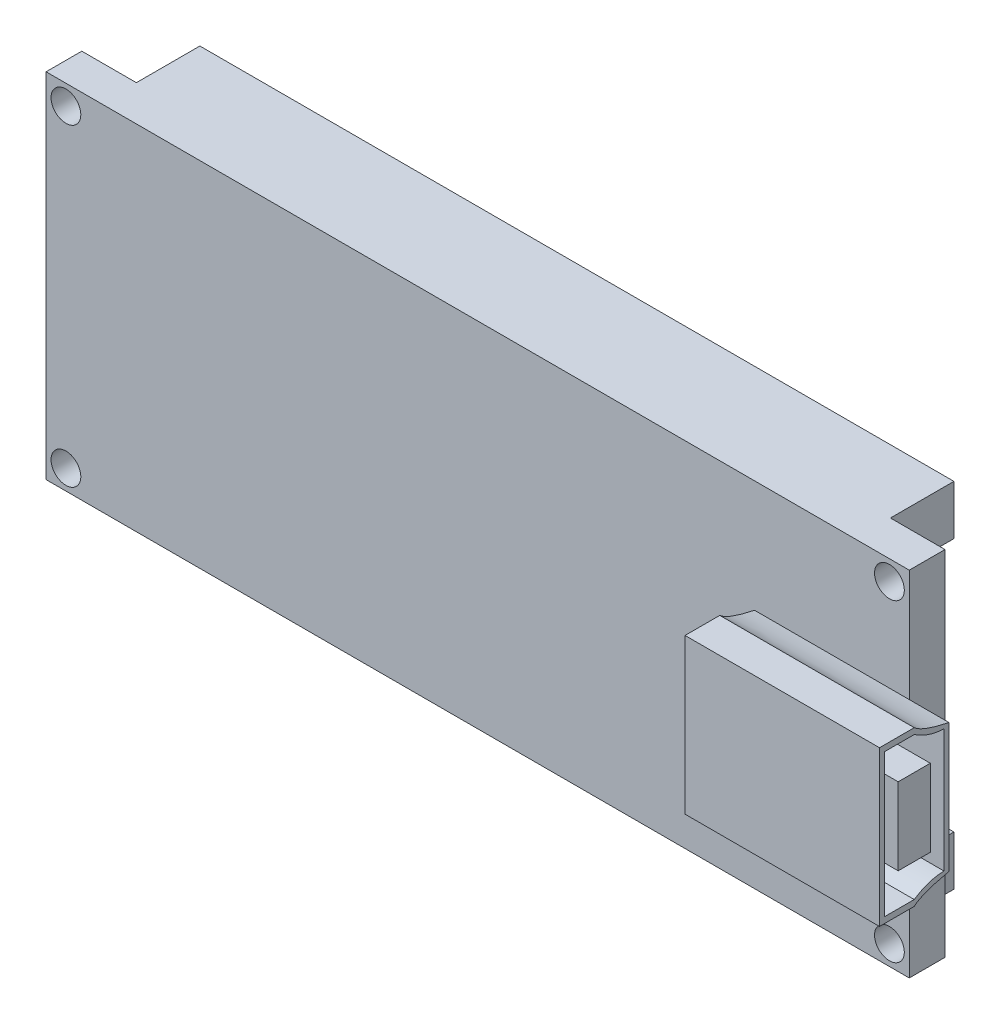
ISO-10303-21;
HEADER;
FILE_DESCRIPTION(('STEP AP214'),'2;1');
FILE_NAME('part.step','',(''),(''),'','','');
FILE_SCHEMA(('AUTOMOTIVE_DESIGN { 1 0 10303 214 1 1 1 1 }'));
ENDSEC;
DATA;
#1=APPLICATION_CONTEXT('core data for automotive mechanical design processes');
#2=APPLICATION_PROTOCOL_DEFINITION('international standard','automotive_design',2000,#1);
#3=PRODUCT_CONTEXT('',#1,'mechanical');
#4=PRODUCT('Part','Part','',(#3));
#5=PRODUCT_RELATED_PRODUCT_CATEGORY('part','',(#4));
#6=PRODUCT_DEFINITION_FORMATION('','',#4);
#7=PRODUCT_DEFINITION_CONTEXT('part definition',#1,'design');
#8=PRODUCT_DEFINITION('design','',#6,#7);
#9=PRODUCT_DEFINITION_SHAPE('','',#8);
#10=(LENGTH_UNIT() NAMED_UNIT(*) SI_UNIT(.MILLI.,.METRE.));
#11=(NAMED_UNIT(*) PLANE_ANGLE_UNIT() SI_UNIT($,.RADIAN.));
#12=(NAMED_UNIT(*) SI_UNIT($,.STERADIAN.) SOLID_ANGLE_UNIT());
#13=UNCERTAINTY_MEASURE_WITH_UNIT(LENGTH_MEASURE(1.E-05),#10,'distance_accuracy_value','');
#14=(GEOMETRIC_REPRESENTATION_CONTEXT(3) GLOBAL_UNCERTAINTY_ASSIGNED_CONTEXT((#13)) GLOBAL_UNIT_ASSIGNED_CONTEXT((#10,
#11,#12)) REPRESENTATION_CONTEXT('',''));
#15=CARTESIAN_POINT('',(0.,0.,0.));
#16=DIRECTION('',(0.,0.,1.));
#17=DIRECTION('',(1.,0.,0.));
#18=AXIS2_PLACEMENT_3D('',#15,#16,#17);
#19=CARTESIAN_POINT('',(0.,0.,0.));
#20=DIRECTION('',(0.,0.,1.));
#21=DIRECTION('',(1.,0.,0.));
#22=AXIS2_PLACEMENT_3D('',#19,#20,#21);
#23=PLANE('',#22);
#24=CARTESIAN_POINT('',(20.75,7.9,0.));
#25=DIRECTION('',(0.,0.,1.));
#26=DIRECTION('',(1.,0.,0.));
#27=AXIS2_PLACEMENT_3D('',#24,#25,#26);
#28=CIRCLE('',#27,0.750000000000002);
#29=CARTESIAN_POINT('',(21.5,7.9,0.));
#30=VERTEX_POINT('',#29);
#31=EDGE_CURVE('E455',#30,#30,#28,.F.);
#32=ORIENTED_EDGE('',*,*,#31,.F.);
#33=EDGE_LOOP('',(#32));
#34=FACE_BOUND('',#33,.T.);
#35=CARTESIAN_POINT('',(-20.75,7.9,0.));
#36=DIRECTION('',(0.,0.,1.));
#37=DIRECTION('',(1.,0.,0.));
#38=AXIS2_PLACEMENT_3D('',#35,#36,#37);
#39=CIRCLE('',#38,0.750000000000002);
#40=CARTESIAN_POINT('',(-20.,7.9,0.));
#41=VERTEX_POINT('',#40);
#42=EDGE_CURVE('E484',#41,#41,#39,.T.);
#43=ORIENTED_EDGE('',*,*,#42,.T.);
#44=EDGE_LOOP('',(#43));
#45=FACE_BOUND('',#44,.T.);
#46=CARTESIAN_POINT('',(20.75,-7.89999999999999,0.));
#47=DIRECTION('',(0.,0.,1.));
#48=DIRECTION('',(1.,0.,0.));
#49=AXIS2_PLACEMENT_3D('',#46,#47,#48);
#50=CIRCLE('',#49,0.750000000000002);
#51=CARTESIAN_POINT('',(21.5,-7.89999999999999,0.));
#52=VERTEX_POINT('',#51);
#53=EDGE_CURVE('E500',#52,#52,#50,.T.);
#54=ORIENTED_EDGE('',*,*,#53,.T.);
#55=EDGE_LOOP('',(#54));
#56=FACE_BOUND('',#55,.T.);
#57=CARTESIAN_POINT('',(-20.75,-7.90000000000001,0.));
#58=DIRECTION('',(0.,0.,1.));
#59=DIRECTION('',(1.,0.,0.));
#60=AXIS2_PLACEMENT_3D('',#57,#58,#59);
#61=CIRCLE('',#60,0.750000000000002);
#62=CARTESIAN_POINT('',(-20.,-7.90000000000001,0.));
#63=VERTEX_POINT('',#62);
#64=EDGE_CURVE('E460',#63,#63,#61,.F.);
#65=ORIENTED_EDGE('',*,*,#64,.F.);
#66=EDGE_LOOP('',(#65));
#67=FACE_BOUND('',#66,.T.);
#68=DIRECTION('',(0.,-1.,0.));
#69=VECTOR('',#68,1.);
#70=CARTESIAN_POINT('',(19.,-6.4,0.));
#71=LINE('',#70,#69);
#72=CARTESIAN_POINT('',(19.,-6.4,0.));
#73=VERTEX_POINT('',#72);
#74=CARTESIAN_POINT('',(19.,-8.9,0.));
#75=VERTEX_POINT('',#74);
#76=EDGE_CURVE('E92',#73,#75,#71,.T.);
#77=ORIENTED_EDGE('',*,*,#76,.F.);
#78=DIRECTION('',(1.,0.,0.));
#79=VECTOR('',#78,1.);
#80=CARTESIAN_POINT('',(-19.,-6.4,0.));
#81=LINE('',#80,#79);
#82=CARTESIAN_POINT('',(-19.,-6.4,0.));
#83=VERTEX_POINT('',#82);
#84=EDGE_CURVE('E97',#83,#73,#81,.T.);
#85=ORIENTED_EDGE('',*,*,#84,.F.);
#86=DIRECTION('',(0.,1.,0.));
#87=VECTOR('',#86,1.);
#88=CARTESIAN_POINT('',(-19.,-6.4,0.));
#89=LINE('',#88,#87);
#90=CARTESIAN_POINT('',(-19.,-8.9,0.));
#91=VERTEX_POINT('',#90);
#92=EDGE_CURVE('E286',#91,#83,#89,.T.);
#93=ORIENTED_EDGE('',*,*,#92,.F.);
#94=DIRECTION('',(-1.,0.,0.));
#95=VECTOR('',#94,1.);
#96=CARTESIAN_POINT('',(0.,-8.9,0.));
#97=LINE('',#96,#95);
#98=CARTESIAN_POINT('',(-21.75,-8.9,0.));
#99=VERTEX_POINT('',#98);
#100=EDGE_CURVE('E490',#91,#99,#97,.T.);
#101=ORIENTED_EDGE('',*,*,#100,.T.);
#102=DIRECTION('',(0.,1.,0.));
#103=VECTOR('',#102,1.);
#104=CARTESIAN_POINT('',(-21.75,0.,0.));
#105=LINE('',#104,#103);
#106=CARTESIAN_POINT('',(-21.75,8.9,0.));
#107=VERTEX_POINT('',#106);
#108=EDGE_CURVE('E487',#99,#107,#105,.T.);
#109=ORIENTED_EDGE('',*,*,#108,.T.);
#110=DIRECTION('',(-1.,0.,0.));
#111=VECTOR('',#110,1.);
#112=CARTESIAN_POINT('',(0.,8.9,0.));
#113=LINE('',#112,#111);
#114=CARTESIAN_POINT('',(-19.,8.9,0.));
#115=VERTEX_POINT('',#114);
#116=EDGE_CURVE('E496',#115,#107,#113,.T.);
#117=ORIENTED_EDGE('',*,*,#116,.F.);
#118=DIRECTION('',(0.,1.,0.));
#119=VECTOR('',#118,1.);
#120=CARTESIAN_POINT('',(-19.,6.4,0.));
#121=LINE('',#120,#119);
#122=CARTESIAN_POINT('',(-19.,6.4,0.));
#123=VERTEX_POINT('',#122);
#124=EDGE_CURVE('E302',#123,#115,#121,.T.);
#125=ORIENTED_EDGE('',*,*,#124,.F.);
#126=DIRECTION('',(-1.,0.,0.));
#127=VECTOR('',#126,1.);
#128=CARTESIAN_POINT('',(-19.,6.4,0.));
#129=LINE('',#128,#127);
#130=CARTESIAN_POINT('',(19.,6.4,0.));
#131=VERTEX_POINT('',#130);
#132=EDGE_CURVE('E292',#131,#123,#129,.T.);
#133=ORIENTED_EDGE('',*,*,#132,.F.);
#134=DIRECTION('',(0.,-1.,0.));
#135=VECTOR('',#134,1.);
#136=CARTESIAN_POINT('',(19.,6.4,0.));
#137=LINE('',#136,#135);
#138=CARTESIAN_POINT('',(19.,8.9,0.));
#139=VERTEX_POINT('',#138);
#140=EDGE_CURVE('E289',#139,#131,#137,.T.);
#141=ORIENTED_EDGE('',*,*,#140,.F.);
#142=CARTESIAN_POINT('',(21.75,8.9,0.));
#143=VERTEX_POINT('',#142);
#144=EDGE_CURVE('E497',#143,#139,#113,.T.);
#145=ORIENTED_EDGE('',*,*,#144,.F.);
#146=DIRECTION('',(0.,1.,0.));
#147=VECTOR('',#146,1.);
#148=CARTESIAN_POINT('',(21.75,0.,0.));
#149=LINE('',#148,#147);
#150=CARTESIAN_POINT('',(21.75,-8.9,0.));
#151=VERTEX_POINT('',#150);
#152=EDGE_CURVE('E493',#151,#143,#149,.T.);
#153=ORIENTED_EDGE('',*,*,#152,.F.);
#154=EDGE_CURVE('E491',#151,#75,#97,.T.);
#155=ORIENTED_EDGE('',*,*,#154,.T.);
#156=EDGE_LOOP('',(#77,#85,#93,#101,#109,#117,#125,#133,#141,#145,#153,#155));
#157=FACE_BOUND('',#156,.T.);
#158=ADVANCED_FACE('F75',(#34,#45,#56,#67,#157),#23,.F.);
#159=CARTESIAN_POINT('',(-21.75,0.,1.8));
#160=DIRECTION('',(-1.,0.,0.));
#161=DIRECTION('',(0.,0.,1.));
#162=AXIS2_PLACEMENT_3D('',#159,#160,#161);
#163=PLANE('',#162);
#164=ORIENTED_EDGE('',*,*,#108,.F.);
#165=DIRECTION('',(0.,0.,-1.));
#166=VECTOR('',#165,1.);
#167=CARTESIAN_POINT('',(-21.75,-8.9,1.8));
#168=LINE('',#167,#166);
#169=CARTESIAN_POINT('',(-21.75,-8.9,1.8));
#170=VERTEX_POINT('',#169);
#171=EDGE_CURVE('E512',#170,#99,#168,.T.);
#172=ORIENTED_EDGE('',*,*,#171,.F.);
#173=DIRECTION('',(0.,1.,0.));
#174=VECTOR('',#173,1.);
#175=CARTESIAN_POINT('',(-21.75,0.,1.8));
#176=LINE('',#175,#174);
#177=CARTESIAN_POINT('',(-21.75,8.9,1.8));
#178=VERTEX_POINT('',#177);
#179=EDGE_CURVE('E463',#170,#178,#176,.T.);
#180=ORIENTED_EDGE('',*,*,#179,.T.);
#181=DIRECTION('',(0.,0.,-1.));
#182=VECTOR('',#181,1.);
#183=CARTESIAN_POINT('',(-21.75,8.9,1.8));
#184=LINE('',#183,#182);
#185=EDGE_CURVE('E481',#178,#107,#184,.T.);
#186=ORIENTED_EDGE('',*,*,#185,.T.);
#187=EDGE_LOOP('',(#164,#172,#180,#186));
#188=FACE_BOUND('',#187,.T.);
#189=ADVANCED_FACE('F563',(#188),#163,.T.);
#190=CARTESIAN_POINT('',(0.,-8.9,1.8));
#191=DIRECTION('',(0.,-1.,0.));
#192=DIRECTION('',(1.,0.,0.));
#193=AXIS2_PLACEMENT_3D('',#190,#191,#192);
#194=PLANE('',#193);
#195=ORIENTED_EDGE('',*,*,#154,.F.);
#196=DIRECTION('',(0.,0.,-1.));
#197=VECTOR('',#196,1.);
#198=CARTESIAN_POINT('',(21.75,-8.9,1.8));
#199=LINE('',#198,#197);
#200=CARTESIAN_POINT('',(21.75,-8.9,1.8));
#201=VERTEX_POINT('',#200);
#202=EDGE_CURVE('E510',#201,#151,#199,.T.);
#203=ORIENTED_EDGE('',*,*,#202,.F.);
#204=DIRECTION('',(-1.,0.,0.));
#205=VECTOR('',#204,1.);
#206=CARTESIAN_POINT('',(0.,-8.9,1.8));
#207=LINE('',#206,#205);
#208=EDGE_CURVE('E465',#201,#170,#207,.T.);
#209=ORIENTED_EDGE('',*,*,#208,.T.);
#210=ORIENTED_EDGE('',*,*,#171,.T.);
#211=ORIENTED_EDGE('',*,*,#100,.F.);
#212=DIRECTION('',(0.,0.,1.));
#213=VECTOR('',#212,1.);
#214=CARTESIAN_POINT('',(-19.,-8.9,-3.2));
#215=LINE('',#214,#213);
#216=CARTESIAN_POINT('',(-19.,-8.9,-3.2));
#217=VERTEX_POINT('',#216);
#218=EDGE_CURVE('E294',#217,#91,#215,.T.);
#219=ORIENTED_EDGE('',*,*,#218,.F.);
#220=DIRECTION('',(-1.,0.,0.));
#221=VECTOR('',#220,1.);
#222=CARTESIAN_POINT('',(-19.,-8.9,-3.2));
#223=LINE('',#222,#221);
#224=CARTESIAN_POINT('',(19.,-8.9,-3.2));
#225=VERTEX_POINT('',#224);
#226=EDGE_CURVE('E276',#225,#217,#223,.T.);
#227=ORIENTED_EDGE('',*,*,#226,.F.);
#228=DIRECTION('',(0.,0.,1.));
#229=VECTOR('',#228,1.);
#230=CARTESIAN_POINT('',(19.,-8.9,-3.2));
#231=LINE('',#230,#229);
#232=EDGE_CURVE('E273',#225,#75,#231,.T.);
#233=ORIENTED_EDGE('',*,*,#232,.T.);
#234=EDGE_LOOP('',(#195,#203,#209,#210,#211,#219,#227,#233));
#235=FACE_BOUND('',#234,.T.);
#236=ADVANCED_FACE('F569',(#235),#194,.T.);
#237=CARTESIAN_POINT('',(21.75,0.,1.8));
#238=DIRECTION('',(-1.,0.,0.));
#239=DIRECTION('',(0.,0.,1.));
#240=AXIS2_PLACEMENT_3D('',#237,#238,#239);
#241=PLANE('',#240);
#242=ORIENTED_EDGE('',*,*,#152,.T.);
#243=DIRECTION('',(0.,0.,-1.));
#244=VECTOR('',#243,1.);
#245=CARTESIAN_POINT('',(21.75,8.9,1.8));
#246=LINE('',#245,#244);
#247=CARTESIAN_POINT('',(21.75,8.9,1.8));
#248=VERTEX_POINT('',#247);
#249=EDGE_CURVE('E507',#248,#143,#246,.T.);
#250=ORIENTED_EDGE('',*,*,#249,.F.);
#251=DIRECTION('',(0.,1.,0.));
#252=VECTOR('',#251,1.);
#253=CARTESIAN_POINT('',(21.75,0.,1.8));
#254=LINE('',#253,#252);
#255=CARTESIAN_POINT('',(21.75,3.25000000000001,1.8));
#256=VERTEX_POINT('',#255);
#257=EDGE_CURVE('E468',#256,#248,#254,.T.);
#258=ORIENTED_EDGE('',*,*,#257,.F.);
#259=CARTESIAN_POINT('',(21.75,-3.24999999999999,1.8));
#260=VERTEX_POINT('',#259);
#261=EDGE_CURVE('E472',#260,#256,#254,.T.);
#262=ORIENTED_EDGE('',*,*,#261,.F.);
#263=EDGE_CURVE('E469',#201,#260,#254,.T.);
#264=ORIENTED_EDGE('',*,*,#263,.F.);
#265=ORIENTED_EDGE('',*,*,#202,.T.);
#266=EDGE_LOOP('',(#242,#250,#258,#262,#264,#265));
#267=FACE_BOUND('',#266,.T.);
#268=ADVANCED_FACE('F585',(#267),#241,.F.);
#269=CARTESIAN_POINT('',(20.75,-7.89999999999999,1.8));
#270=DIRECTION('',(0.,0.,-1.));
#271=DIRECTION('',(-1.,0.,0.));
#272=AXIS2_PLACEMENT_3D('',#269,#270,#271);
#273=CYLINDRICAL_SURFACE('',#272,0.750000000000002);
#274=CARTESIAN_POINT('',(20.75,-7.89999999999999,1.8));
#275=DIRECTION('',(0.,0.,1.));
#276=DIRECTION('',(1.,0.,0.));
#277=AXIS2_PLACEMENT_3D('',#274,#275,#276);
#278=CIRCLE('',#277,0.750000000000002);
#279=CARTESIAN_POINT('',(21.5,-7.89999999999999,1.8));
#280=VERTEX_POINT('',#279);
#281=EDGE_CURVE('E475',#280,#280,#278,.T.);
#282=ORIENTED_EDGE('',*,*,#281,.T.);
#283=EDGE_LOOP('',(#282));
#284=FACE_BOUND('',#283,.T.);
#285=ORIENTED_EDGE('',*,*,#53,.F.);
#286=EDGE_LOOP('',(#285));
#287=FACE_BOUND('',#286,.T.);
#288=ADVANCED_FACE('F581',(#284,#287),#273,.F.);
#289=CARTESIAN_POINT('',(0.,8.9,1.8));
#290=DIRECTION('',(0.,-1.,0.));
#291=DIRECTION('',(1.,0.,0.));
#292=AXIS2_PLACEMENT_3D('',#289,#290,#291);
#293=PLANE('',#292);
#294=ORIENTED_EDGE('',*,*,#144,.T.);
#295=DIRECTION('',(0.,0.,1.));
#296=VECTOR('',#295,1.);
#297=CARTESIAN_POINT('',(19.,8.9,-3.2));
#298=LINE('',#297,#296);
#299=CARTESIAN_POINT('',(19.,8.9,-3.2));
#300=VERTEX_POINT('',#299);
#301=EDGE_CURVE('E307',#300,#139,#298,.T.);
#302=ORIENTED_EDGE('',*,*,#301,.F.);
#303=DIRECTION('',(1.,0.,0.));
#304=VECTOR('',#303,1.);
#305=CARTESIAN_POINT('',(-19.,8.9,-3.2));
#306=LINE('',#305,#304);
#307=CARTESIAN_POINT('',(-19.,8.9,-3.2));
#308=VERTEX_POINT('',#307);
#309=EDGE_CURVE('E306',#308,#300,#306,.T.);
#310=ORIENTED_EDGE('',*,*,#309,.F.);
#311=DIRECTION('',(0.,0.,1.));
#312=VECTOR('',#311,1.);
#313=CARTESIAN_POINT('',(-19.,8.9,-3.2));
#314=LINE('',#313,#312);
#315=EDGE_CURVE('E315',#308,#115,#314,.T.);
#316=ORIENTED_EDGE('',*,*,#315,.T.);
#317=ORIENTED_EDGE('',*,*,#116,.T.);
#318=ORIENTED_EDGE('',*,*,#185,.F.);
#319=DIRECTION('',(-1.,0.,0.));
#320=VECTOR('',#319,1.);
#321=CARTESIAN_POINT('',(0.,8.9,1.8));
#322=LINE('',#321,#320);
#323=EDGE_CURVE('E471',#248,#178,#322,.T.);
#324=ORIENTED_EDGE('',*,*,#323,.F.);
#325=ORIENTED_EDGE('',*,*,#249,.T.);
#326=EDGE_LOOP('',(#294,#302,#310,#316,#317,#318,#324,#325));
#327=FACE_BOUND('',#326,.T.);
#328=ADVANCED_FACE('F584',(#327),#293,.F.);
#329=CARTESIAN_POINT('',(-20.75,7.9,1.8));
#330=DIRECTION('',(0.,0.,-1.));
#331=DIRECTION('',(-1.,0.,0.));
#332=AXIS2_PLACEMENT_3D('',#329,#330,#331);
#333=CYLINDRICAL_SURFACE('',#332,0.750000000000002);
#334=CARTESIAN_POINT('',(-20.75,7.9,1.8));
#335=DIRECTION('',(0.,0.,1.));
#336=DIRECTION('',(1.,0.,0.));
#337=AXIS2_PLACEMENT_3D('',#334,#335,#336);
#338=CIRCLE('',#337,0.750000000000002);
#339=CARTESIAN_POINT('',(-20.,7.9,1.8));
#340=VERTEX_POINT('',#339);
#341=EDGE_CURVE('E459',#340,#340,#338,.T.);
#342=ORIENTED_EDGE('',*,*,#341,.T.);
#343=EDGE_LOOP('',(#342));
#344=FACE_BOUND('',#343,.T.);
#345=ORIENTED_EDGE('',*,*,#42,.F.);
#346=EDGE_LOOP('',(#345));
#347=FACE_BOUND('',#346,.T.);
#348=ADVANCED_FACE('F589',(#344,#347),#333,.F.);
#349=CARTESIAN_POINT('',(20.75,7.9,1.8));
#350=DIRECTION('',(0.,0.,-1.));
#351=DIRECTION('',(-1.,0.,0.));
#352=AXIS2_PLACEMENT_3D('',#349,#350,#351);
#353=CYLINDRICAL_SURFACE('',#352,0.750000000000002);
#354=CARTESIAN_POINT('',(20.75,7.9,1.8));
#355=DIRECTION('',(0.,0.,1.));
#356=DIRECTION('',(1.,0.,0.));
#357=AXIS2_PLACEMENT_3D('',#354,#355,#356);
#358=CIRCLE('',#357,0.750000000000002);
#359=CARTESIAN_POINT('',(21.5,7.9,1.8));
#360=VERTEX_POINT('',#359);
#361=EDGE_CURVE('E456',#360,#360,#358,.F.);
#362=ORIENTED_EDGE('',*,*,#361,.F.);
#363=EDGE_LOOP('',(#362));
#364=FACE_BOUND('',#363,.T.);
#365=ORIENTED_EDGE('',*,*,#31,.T.);
#366=EDGE_LOOP('',(#365));
#367=FACE_BOUND('',#366,.T.);
#368=ADVANCED_FACE('F77',(#364,#367),#353,.F.);
#369=CARTESIAN_POINT('',(-20.75,-7.90000000000001,1.8));
#370=DIRECTION('',(0.,0.,-1.));
#371=DIRECTION('',(-1.,0.,0.));
#372=AXIS2_PLACEMENT_3D('',#369,#370,#371);
#373=CYLINDRICAL_SURFACE('',#372,0.750000000000002);
#374=CARTESIAN_POINT('',(-20.75,-7.90000000000001,1.8));
#375=DIRECTION('',(0.,0.,1.));
#376=DIRECTION('',(1.,0.,0.));
#377=AXIS2_PLACEMENT_3D('',#374,#375,#376);
#378=CIRCLE('',#377,0.750000000000002);
#379=CARTESIAN_POINT('',(-20.,-7.90000000000001,1.8));
#380=VERTEX_POINT('',#379);
#381=EDGE_CURVE('E478',#380,#380,#378,.F.);
#382=ORIENTED_EDGE('',*,*,#381,.F.);
#383=EDGE_LOOP('',(#382));
#384=FACE_BOUND('',#383,.T.);
#385=ORIENTED_EDGE('',*,*,#64,.T.);
#386=EDGE_LOOP('',(#385));
#387=FACE_BOUND('',#386,.T.);
#388=ADVANCED_FACE('F577',(#384,#387),#373,.F.);
#389=CARTESIAN_POINT('',(0.,0.,1.8));
#390=DIRECTION('',(0.,0.,1.));
#391=DIRECTION('',(1.,0.,0.));
#392=AXIS2_PLACEMENT_3D('',#389,#390,#391);
#393=PLANE('',#392);
#394=ORIENTED_EDGE('',*,*,#323,.T.);
#395=ORIENTED_EDGE('',*,*,#179,.F.);
#396=ORIENTED_EDGE('',*,*,#208,.F.);
#397=ORIENTED_EDGE('',*,*,#263,.T.);
#398=DIRECTION('',(1.,0.,0.));
#399=VECTOR('',#398,1.);
#400=CARTESIAN_POINT('',(-21.75,-3.25000000000001,1.8));
#401=LINE('',#400,#399);
#402=CARTESIAN_POINT('',(13.95,-3.24999999999999,1.8));
#403=VERTEX_POINT('',#402);
#404=EDGE_CURVE('E400',#403,#260,#401,.T.);
#405=ORIENTED_EDGE('',*,*,#404,.F.);
#406=DIRECTION('',(0.,-1.,0.));
#407=VECTOR('',#406,1.);
#408=CARTESIAN_POINT('',(13.95,3.9,1.8));
#409=LINE('',#408,#407);
#410=CARTESIAN_POINT('',(13.95,3.25000000000001,1.8));
#411=VERTEX_POINT('',#410);
#412=EDGE_CURVE('E433',#411,#403,#409,.T.);
#413=ORIENTED_EDGE('',*,*,#412,.F.);
#414=DIRECTION('',(1.,0.,0.));
#415=VECTOR('',#414,1.);
#416=CARTESIAN_POINT('',(-21.75,3.24999999999999,1.8));
#417=LINE('',#416,#415);
#418=EDGE_CURVE('E407',#411,#256,#417,.T.);
#419=ORIENTED_EDGE('',*,*,#418,.T.);
#420=ORIENTED_EDGE('',*,*,#257,.T.);
#421=EDGE_LOOP('',(#394,#395,#396,#397,#405,#413,#419,#420));
#422=FACE_BOUND('',#421,.T.);
#423=ORIENTED_EDGE('',*,*,#281,.F.);
#424=EDGE_LOOP('',(#423));
#425=FACE_BOUND('',#424,.T.);
#426=ORIENTED_EDGE('',*,*,#381,.T.);
#427=EDGE_LOOP('',(#426));
#428=FACE_BOUND('',#427,.T.);
#429=ORIENTED_EDGE('',*,*,#341,.F.);
#430=EDGE_LOOP('',(#429));
#431=FACE_BOUND('',#430,.T.);
#432=ORIENTED_EDGE('',*,*,#361,.T.);
#433=EDGE_LOOP('',(#432));
#434=FACE_BOUND('',#433,.T.);
#435=ADVANCED_FACE('F553',(#422,#425,#428,#431,#434),#393,.T.);
#436=CARTESIAN_POINT('',(0.,0.,1.8));
#437=DIRECTION('',(0.,0.,1.));
#438=DIRECTION('',(1.,0.,0.));
#439=AXIS2_PLACEMENT_3D('',#436,#437,#438);
#440=PLANE('',#439);
#441=ORIENTED_EDGE('',*,*,#261,.T.);
#442=CARTESIAN_POINT('',(23.75,3.25000000000001,1.8));
#443=VERTEX_POINT('',#442);
#444=EDGE_CURVE('E399',#256,#443,#417,.T.);
#445=ORIENTED_EDGE('',*,*,#444,.T.);
#446=DIRECTION('',(0.,1.,0.));
#447=VECTOR('',#446,1.);
#448=CARTESIAN_POINT('',(23.75,3.9,1.8));
#449=LINE('',#448,#447);
#450=CARTESIAN_POINT('',(23.75,-3.24999999999999,1.8));
#451=VERTEX_POINT('',#450);
#452=EDGE_CURVE('E406',#451,#443,#449,.T.);
#453=ORIENTED_EDGE('',*,*,#452,.F.);
#454=EDGE_CURVE('E422',#260,#451,#401,.T.);
#455=ORIENTED_EDGE('',*,*,#454,.F.);
#456=EDGE_LOOP('',(#441,#445,#453,#455));
#457=FACE_BOUND('',#456,.T.);
#458=ADVANCED_FACE('F549',(#457),#440,.F.);
#459=CARTESIAN_POINT('',(23.75,-3.9,5.3));
#460=DIRECTION('',(0.,1.,0.));
#461=DIRECTION('',(-1.,0.,0.));
#462=AXIS2_PLACEMENT_3D('',#459,#460,#461);
#463=PLANE('',#462);
#464=DIRECTION('',(0.,0.,-1.));
#465=VECTOR('',#464,1.);
#466=CARTESIAN_POINT('',(13.95,-3.9,5.3));
#467=LINE('',#466,#465);
#468=CARTESIAN_POINT('',(13.95,-3.9,5.3));
#469=VERTEX_POINT('',#468);
#470=CARTESIAN_POINT('',(13.95,-3.9,3.55));
#471=VERTEX_POINT('',#470);
#472=EDGE_CURVE('E439',#469,#471,#467,.T.);
#473=ORIENTED_EDGE('',*,*,#472,.T.);
#474=DIRECTION('',(1.,0.,0.));
#475=VECTOR('',#474,1.);
#476=CARTESIAN_POINT('',(-21.75,-3.90000000000002,3.55));
#477=LINE('',#476,#475);
#478=CARTESIAN_POINT('',(23.75,-3.9,3.55));
#479=VERTEX_POINT('',#478);
#480=EDGE_CURVE('E420',#471,#479,#477,.T.);
#481=ORIENTED_EDGE('',*,*,#480,.T.);
#482=DIRECTION('',(0.,0.,-1.));
#483=VECTOR('',#482,1.);
#484=CARTESIAN_POINT('',(23.75,-3.9,5.3));
#485=LINE('',#484,#483);
#486=CARTESIAN_POINT('',(23.75,-3.9,5.3));
#487=VERTEX_POINT('',#486);
#488=EDGE_CURVE('E452',#487,#479,#485,.T.);
#489=ORIENTED_EDGE('',*,*,#488,.F.);
#490=DIRECTION('',(1.,0.,0.));
#491=VECTOR('',#490,1.);
#492=CARTESIAN_POINT('',(23.75,-3.9,5.3));
#493=LINE('',#492,#491);
#494=EDGE_CURVE('E429',#469,#487,#493,.T.);
#495=ORIENTED_EDGE('',*,*,#494,.F.);
#496=EDGE_LOOP('',(#473,#481,#489,#495));
#497=FACE_BOUND('',#496,.T.);
#498=ADVANCED_FACE('F530',(#497),#463,.F.);
#499=CARTESIAN_POINT('',(23.75,3.9,5.3));
#500=DIRECTION('',(-1.,0.,0.));
#501=DIRECTION('',(0.,-1.,0.));
#502=AXIS2_PLACEMENT_3D('',#499,#500,#501);
#503=PLANE('',#502);
#504=DIRECTION('',(0.,1.,0.));
#505=VECTOR('',#504,1.);
#506=CARTESIAN_POINT('',(23.75,-3.10584948659047,2.05));
#507=LINE('',#506,#505);
#508=CARTESIAN_POINT('',(23.75,-3.10584948659047,2.05));
#509=VERTEX_POINT('',#508);
#510=CARTESIAN_POINT('',(23.75,3.10584948659049,2.05000000000001));
#511=VERTEX_POINT('',#510);
#512=EDGE_CURVE('E708',#509,#511,#507,.T.);
#513=ORIENTED_EDGE('',*,*,#512,.F.);
#514=CARTESIAN_POINT('',(23.75,-3.59999999999999,3.55));
#515=CARTESIAN_POINT('',(23.75,-3.11925763226889,2.83749773244966));
#516=CARTESIAN_POINT('',(23.75,-3.10584948659047,2.05));
#517=B_SPLINE_CURVE_WITH_KNOTS('',2,(#514,#515,#516),.UNSPECIFIED.,.F.,.F.,(3,3),(0.,
0.945732543766456),.UNSPECIFIED.);
#518=CARTESIAN_POINT('',(23.75,-3.59999999999999,3.55));
#519=VERTEX_POINT('',#518);
#520=EDGE_CURVE('E349',#519,#509,#517,.T.);
#521=ORIENTED_EDGE('',*,*,#520,.F.);
#522=DIRECTION('',(0.,0.,1.));
#523=VECTOR('',#522,1.);
#524=CARTESIAN_POINT('',(23.75,-3.59999999999999,3.55));
#525=LINE('',#524,#523);
#526=CARTESIAN_POINT('',(23.75,-3.59999999999999,5.05));
#527=VERTEX_POINT('',#526);
#528=EDGE_CURVE('E363',#519,#527,#525,.T.);
#529=ORIENTED_EDGE('',*,*,#528,.T.);
#530=DIRECTION('',(0.,1.,0.));
#531=VECTOR('',#530,1.);
#532=CARTESIAN_POINT('',(23.75,-3.59999999999999,5.05));
#533=LINE('',#532,#531);
#534=CARTESIAN_POINT('',(23.75,3.60000000000001,5.05));
#535=VERTEX_POINT('',#534);
#536=EDGE_CURVE('E725',#527,#535,#533,.T.);
#537=ORIENTED_EDGE('',*,*,#536,.T.);
#538=DIRECTION('',(0.,0.,1.));
#539=VECTOR('',#538,1.);
#540=CARTESIAN_POINT('',(23.75,3.6,3.55000000000002));
#541=LINE('',#540,#539);
#542=CARTESIAN_POINT('',(23.75,3.60000000000001,3.55));
#543=VERTEX_POINT('',#542);
#544=EDGE_CURVE('E719',#543,#535,#541,.T.);
#545=ORIENTED_EDGE('',*,*,#544,.F.);
#546=CARTESIAN_POINT('',(23.75,3.60000000000001,3.55));
#547=CARTESIAN_POINT('',(23.75,3.11925763226891,2.83749773244966));
#548=CARTESIAN_POINT('',(23.75,3.10584948659049,2.05));
#549=B_SPLINE_CURVE_WITH_KNOTS('',2,(#546,#547,#548),.UNSPECIFIED.,.F.,.F.,(3,3),(0.,
0.945732543766456),.UNSPECIFIED.);
#550=EDGE_CURVE('E714',#543,#511,#549,.T.);
#551=ORIENTED_EDGE('',*,*,#550,.T.);
#552=EDGE_LOOP('',(#513,#521,#529,#537,#545,#551));
#553=FACE_BOUND('',#552,.T.);
#554=ORIENTED_EDGE('',*,*,#452,.T.);
#555=CARTESIAN_POINT('',(23.75,3.90000000000002,3.55));
#556=CARTESIAN_POINT('',(23.75,3.52815287358365,3.13854333949347));
#557=CARTESIAN_POINT('',(23.75,3.25000000000001,1.8));
#558=B_SPLINE_CURVE_WITH_KNOTS('',2,(#555,#556,#557),.UNSPECIFIED.,.F.,.F.,(3,3),(0.,
0.396074416604508),.UNSPECIFIED.);
#559=CARTESIAN_POINT('',(23.75,3.9,3.55));
#560=VERTEX_POINT('',#559);
#561=EDGE_CURVE('E392',#560,#443,#558,.T.);
#562=ORIENTED_EDGE('',*,*,#561,.F.);
#563=DIRECTION('',(0.,0.,-1.));
#564=VECTOR('',#563,1.);
#565=CARTESIAN_POINT('',(23.75,3.9,5.3));
#566=LINE('',#565,#564);
#567=CARTESIAN_POINT('',(23.75,3.9,5.3));
#568=VERTEX_POINT('',#567);
#569=EDGE_CURVE('E449',#568,#560,#566,.T.);
#570=ORIENTED_EDGE('',*,*,#569,.F.);
#571=DIRECTION('',(0.,1.,0.));
#572=VECTOR('',#571,1.);
#573=CARTESIAN_POINT('',(23.75,3.9,5.3));
#574=LINE('',#573,#572);
#575=EDGE_CURVE('E432',#487,#568,#574,.T.);
#576=ORIENTED_EDGE('',*,*,#575,.F.);
#577=ORIENTED_EDGE('',*,*,#488,.T.);
#578=CARTESIAN_POINT('',(23.75,-3.24999999999999,1.8));
#579=CARTESIAN_POINT('',(23.75,-3.52815287358363,3.13854333949347));
#580=CARTESIAN_POINT('',(23.75,-3.9,3.55));
#581=B_SPLINE_CURVE_WITH_KNOTS('',2,(#578,#579,#580),.UNSPECIFIED.,.F.,.F.,(3,3),(0.,
0.396074416604508),.UNSPECIFIED.);
#582=EDGE_CURVE('E413',#451,#479,#581,.T.);
#583=ORIENTED_EDGE('',*,*,#582,.F.);
#584=EDGE_LOOP('',(#554,#562,#570,#576,#577,#583));
#585=FACE_BOUND('',#584,.T.);
#586=ADVANCED_FACE('F543',(#553,#585),#503,.F.);
#587=CARTESIAN_POINT('',(13.95,3.9,5.3));
#588=DIRECTION('',(0.,-1.,0.));
#589=DIRECTION('',(0.,0.,-1.));
#590=AXIS2_PLACEMENT_3D('',#587,#588,#589);
#591=PLANE('',#590);
#592=ORIENTED_EDGE('',*,*,#569,.T.);
#593=DIRECTION('',(1.,0.,0.));
#594=VECTOR('',#593,1.);
#595=CARTESIAN_POINT('',(-21.75,3.89999999999998,3.55));
#596=LINE('',#595,#594);
#597=CARTESIAN_POINT('',(13.95,3.9,3.55));
#598=VERTEX_POINT('',#597);
#599=EDGE_CURVE('E401',#598,#560,#596,.T.);
#600=ORIENTED_EDGE('',*,*,#599,.F.);
#601=DIRECTION('',(0.,0.,-1.));
#602=VECTOR('',#601,1.);
#603=CARTESIAN_POINT('',(13.95,3.9,5.3));
#604=LINE('',#603,#602);
#605=CARTESIAN_POINT('',(13.95,3.9,5.3));
#606=VERTEX_POINT('',#605);
#607=EDGE_CURVE('E446',#606,#598,#604,.T.);
#608=ORIENTED_EDGE('',*,*,#607,.F.);
#609=DIRECTION('',(-1.,0.,0.));
#610=VECTOR('',#609,1.);
#611=CARTESIAN_POINT('',(13.95,3.9,5.3));
#612=LINE('',#611,#610);
#613=EDGE_CURVE('E435',#568,#606,#612,.T.);
#614=ORIENTED_EDGE('',*,*,#613,.F.);
#615=EDGE_LOOP('',(#592,#600,#608,#614));
#616=FACE_BOUND('',#615,.T.);
#617=ADVANCED_FACE('F539',(#616),#591,.F.);
#618=CARTESIAN_POINT('',(13.95,3.9,5.3));
#619=DIRECTION('',(1.,0.,0.));
#620=DIRECTION('',(0.,1.,0.));
#621=AXIS2_PLACEMENT_3D('',#618,#619,#620);
#622=PLANE('',#621);
#623=ORIENTED_EDGE('',*,*,#607,.T.);
#624=CARTESIAN_POINT('',(13.95,3.90000000000001,3.55));
#625=CARTESIAN_POINT('',(13.95,3.52815287358365,3.13854333949347));
#626=CARTESIAN_POINT('',(13.95,3.25000000000001,1.8));
#627=B_SPLINE_CURVE_WITH_KNOTS('',2,(#624,#625,#626),.UNSPECIFIED.,.F.,.F.,(3,3),(0.,
0.396074416604508),.UNSPECIFIED.);
#628=EDGE_CURVE('E12',#598,#411,#627,.T.);
#629=ORIENTED_EDGE('',*,*,#628,.T.);
#630=ORIENTED_EDGE('',*,*,#412,.T.);
#631=CARTESIAN_POINT('',(13.95,-3.24999999999999,1.8));
#632=CARTESIAN_POINT('',(13.95,-3.52815287358363,3.13854333949347));
#633=CARTESIAN_POINT('',(13.95,-3.9,3.55));
#634=B_SPLINE_CURVE_WITH_KNOTS('',2,(#631,#632,#633),.UNSPECIFIED.,.F.,.F.,(3,3),(0.,
0.396074416604508),.UNSPECIFIED.);
#635=EDGE_CURVE('E85',#403,#471,#634,.T.);
#636=ORIENTED_EDGE('',*,*,#635,.T.);
#637=ORIENTED_EDGE('',*,*,#472,.F.);
#638=DIRECTION('',(0.,-1.,0.));
#639=VECTOR('',#638,1.);
#640=CARTESIAN_POINT('',(13.95,3.9,5.3));
#641=LINE('',#640,#639);
#642=EDGE_CURVE('E437',#606,#469,#641,.T.);
#643=ORIENTED_EDGE('',*,*,#642,.F.);
#644=EDGE_LOOP('',(#623,#629,#630,#636,#637,#643));
#645=FACE_BOUND('',#644,.T.);
#646=ADVANCED_FACE('F523',(#645),#622,.F.);
#647=CARTESIAN_POINT('',(0.,0.,5.3));
#648=DIRECTION('',(0.,0.,1.));
#649=DIRECTION('',(1.,0.,0.));
#650=AXIS2_PLACEMENT_3D('',#647,#648,#649);
#651=PLANE('',#650);
#652=ORIENTED_EDGE('',*,*,#494,.T.);
#653=ORIENTED_EDGE('',*,*,#575,.T.);
#654=ORIENTED_EDGE('',*,*,#613,.T.);
#655=ORIENTED_EDGE('',*,*,#642,.T.);
#656=EDGE_LOOP('',(#652,#653,#654,#655));
#657=FACE_BOUND('',#656,.T.);
#658=ADVANCED_FACE('F533',(#657),#651,.T.);
#659=CARTESIAN_POINT('',(-21.75,-3.25000000000001,1.8));
#660=CARTESIAN_POINT('',(-21.75,-3.52815287358365,3.13854333949347));
#661=CARTESIAN_POINT('',(-21.75,-3.90000000000002,3.55));
#662=B_SPLINE_CURVE_WITH_KNOTS('',2,(#659,#660,#661),.UNSPECIFIED.,.F.,.F.,(3,3),(0.,
0.396074416604508),.UNSPECIFIED.);
#663=DIRECTION('',(1.,0.,0.));
#664=VECTOR('',#663,1.);
#665=SURFACE_OF_LINEAR_EXTRUSION('',#662,#664);
#666=ORIENTED_EDGE('',*,*,#404,.T.);
#667=ORIENTED_EDGE('',*,*,#454,.T.);
#668=ORIENTED_EDGE('',*,*,#582,.T.);
#669=ORIENTED_EDGE('',*,*,#480,.F.);
#670=ORIENTED_EDGE('',*,*,#635,.F.);
#671=EDGE_LOOP('',(#666,#667,#668,#669,#670));
#672=FACE_BOUND('',#671,.T.);
#673=ADVANCED_FACE('F381',(#672),#665,.F.);
#674=CARTESIAN_POINT('',(-21.75,3.9,3.55));
#675=CARTESIAN_POINT('',(-21.75,3.52815287358363,3.13854333949347));
#676=CARTESIAN_POINT('',(-21.75,3.24999999999999,1.8));
#677=B_SPLINE_CURVE_WITH_KNOTS('',2,(#674,#675,#676),.UNSPECIFIED.,.F.,.F.,(3,3),(0.,
0.396074416604508),.UNSPECIFIED.);
#678=DIRECTION('',(1.,0.,0.));
#679=VECTOR('',#678,1.);
#680=SURFACE_OF_LINEAR_EXTRUSION('',#677,#679);
#681=ORIENTED_EDGE('',*,*,#599,.T.);
#682=ORIENTED_EDGE('',*,*,#561,.T.);
#683=ORIENTED_EDGE('',*,*,#444,.F.);
#684=ORIENTED_EDGE('',*,*,#418,.F.);
#685=ORIENTED_EDGE('',*,*,#628,.F.);
#686=EDGE_LOOP('',(#681,#682,#683,#684,#685));
#687=FACE_BOUND('',#686,.T.);
#688=ADVANCED_FACE('F374',(#687),#680,.F.);
#689=CARTESIAN_POINT('',(15.25,-3.6,3.55));
#690=CARTESIAN_POINT('',(15.25,-3.1192576322689,2.83749773244966));
#691=CARTESIAN_POINT('',(15.25,-3.10584948659047,2.05));
#692=B_SPLINE_CURVE_WITH_KNOTS('',2,(#689,#690,#691),.UNSPECIFIED.,.F.,.F.,(3,3),(0.,
0.945732543766456),.UNSPECIFIED.);
#693=DIRECTION('',(1.,0.,0.));
#694=VECTOR('',#693,1.);
#695=SURFACE_OF_LINEAR_EXTRUSION('',#692,#694);
#696=ORIENTED_EDGE('',*,*,#520,.T.);
#697=DIRECTION('',(1.,0.,0.));
#698=VECTOR('',#697,1.);
#699=CARTESIAN_POINT('',(15.25,-3.10584948659047,2.05));
#700=LINE('',#699,#698);
#701=CARTESIAN_POINT('',(15.25,-3.10584948659047,2.05));
#702=VERTEX_POINT('',#701);
#703=EDGE_CURVE('E390',#702,#509,#700,.T.);
#704=ORIENTED_EDGE('',*,*,#703,.F.);
#705=CARTESIAN_POINT('',(15.25,-3.6,3.55));
#706=VERTEX_POINT('',#705);
#707=EDGE_CURVE('E356',#706,#702,#692,.T.);
#708=ORIENTED_EDGE('',*,*,#707,.F.);
#709=DIRECTION('',(1.,0.,0.));
#710=VECTOR('',#709,1.);
#711=CARTESIAN_POINT('',(15.25,-3.6,3.55));
#712=LINE('',#711,#710);
#713=EDGE_CURVE('E421',#706,#519,#712,.T.);
#714=ORIENTED_EDGE('',*,*,#713,.T.);
#715=EDGE_LOOP('',(#696,#704,#708,#714));
#716=FACE_BOUND('',#715,.T.);
#717=ADVANCED_FACE('F369',(#716),#695,.F.);
#718=CARTESIAN_POINT('',(15.25,-3.6,3.55));
#719=DIRECTION('',(0.,1.,0.));
#720=DIRECTION('',(-1.,0.,0.));
#721=AXIS2_PLACEMENT_3D('',#718,#719,#720);
#722=PLANE('',#721);
#723=ORIENTED_EDGE('',*,*,#528,.F.);
#724=ORIENTED_EDGE('',*,*,#713,.F.);
#725=DIRECTION('',(0.,0.,1.));
#726=VECTOR('',#725,1.);
#727=CARTESIAN_POINT('',(15.25,-3.6,3.55));
#728=LINE('',#727,#726);
#729=CARTESIAN_POINT('',(15.25,-3.6,5.05));
#730=VERTEX_POINT('',#729);
#731=EDGE_CURVE('E703',#706,#730,#728,.T.);
#732=ORIENTED_EDGE('',*,*,#731,.T.);
#733=DIRECTION('',(1.,0.,0.));
#734=VECTOR('',#733,1.);
#735=CARTESIAN_POINT('',(15.25,-3.6,5.05));
#736=LINE('',#735,#734);
#737=EDGE_CURVE('E731',#730,#527,#736,.T.);
#738=ORIENTED_EDGE('',*,*,#737,.T.);
#739=EDGE_LOOP('',(#723,#724,#732,#738));
#740=FACE_BOUND('',#739,.T.);
#741=ADVANCED_FACE('F373',(#740),#722,.T.);
#742=CARTESIAN_POINT('',(15.25,-3.6,5.05));
#743=DIRECTION('',(0.,0.,-1.));
#744=DIRECTION('',(-1.,0.,0.));
#745=AXIS2_PLACEMENT_3D('',#742,#743,#744);
#746=PLANE('',#745);
#747=ORIENTED_EDGE('',*,*,#536,.F.);
#748=ORIENTED_EDGE('',*,*,#737,.F.);
#749=DIRECTION('',(0.,1.,0.));
#750=VECTOR('',#749,1.);
#751=CARTESIAN_POINT('',(15.25,-3.6,5.05));
#752=LINE('',#751,#750);
#753=CARTESIAN_POINT('',(15.25,3.6,5.05));
#754=VERTEX_POINT('',#753);
#755=EDGE_CURVE('E701',#730,#754,#752,.T.);
#756=ORIENTED_EDGE('',*,*,#755,.T.);
#757=DIRECTION('',(1.,0.,0.));
#758=VECTOR('',#757,1.);
#759=CARTESIAN_POINT('',(15.25,3.6,5.05));
#760=LINE('',#759,#758);
#761=EDGE_CURVE('E733',#754,#535,#760,.T.);
#762=ORIENTED_EDGE('',*,*,#761,.T.);
#763=EDGE_LOOP('',(#747,#748,#756,#762));
#764=FACE_BOUND('',#763,.T.);
#765=ADVANCED_FACE('F679',(#764),#746,.T.);
#766=CARTESIAN_POINT('',(15.25,3.6,3.55000000000002));
#767=DIRECTION('',(0.,1.,0.));
#768=DIRECTION('',(0.,0.,1.));
#769=AXIS2_PLACEMENT_3D('',#766,#767,#768);
#770=PLANE('',#769);
#771=ORIENTED_EDGE('',*,*,#544,.T.);
#772=ORIENTED_EDGE('',*,*,#761,.F.);
#773=DIRECTION('',(0.,0.,1.));
#774=VECTOR('',#773,1.);
#775=CARTESIAN_POINT('',(15.25,3.6,3.55000000000002));
#776=LINE('',#775,#774);
#777=CARTESIAN_POINT('',(15.25,3.60000000000001,3.55));
#778=VERTEX_POINT('',#777);
#779=EDGE_CURVE('E695',#778,#754,#776,.T.);
#780=ORIENTED_EDGE('',*,*,#779,.F.);
#781=DIRECTION('',(1.,0.,0.));
#782=VECTOR('',#781,1.);
#783=CARTESIAN_POINT('',(15.25,3.60000000000001,3.55));
#784=LINE('',#783,#782);
#785=EDGE_CURVE('E735',#778,#543,#784,.T.);
#786=ORIENTED_EDGE('',*,*,#785,.T.);
#787=EDGE_LOOP('',(#771,#772,#780,#786));
#788=FACE_BOUND('',#787,.T.);
#789=ADVANCED_FACE('F683',(#788),#770,.F.);
#790=CARTESIAN_POINT('',(15.25,3.60000000000001,3.55));
#791=CARTESIAN_POINT('',(15.25,3.11925763226891,2.83749773244966));
#792=CARTESIAN_POINT('',(15.25,3.10584948659048,2.05));
#793=B_SPLINE_CURVE_WITH_KNOTS('',2,(#790,#791,#792),.UNSPECIFIED.,.F.,.F.,(3,3),(0.,
0.945732543766456),.UNSPECIFIED.);
#794=DIRECTION('',(1.,0.,0.));
#795=VECTOR('',#794,1.);
#796=SURFACE_OF_LINEAR_EXTRUSION('',#793,#795);
#797=ORIENTED_EDGE('',*,*,#550,.F.);
#798=ORIENTED_EDGE('',*,*,#785,.F.);
#799=CARTESIAN_POINT('',(15.25,3.10584948659048,2.05000000000001));
#800=VERTEX_POINT('',#799);
#801=EDGE_CURVE('E690',#778,#800,#793,.T.);
#802=ORIENTED_EDGE('',*,*,#801,.T.);
#803=DIRECTION('',(1.,0.,0.));
#804=VECTOR('',#803,1.);
#805=CARTESIAN_POINT('',(15.25,3.10584948659048,2.05000000000001));
#806=LINE('',#805,#804);
#807=EDGE_CURVE('E736',#800,#511,#806,.T.);
#808=ORIENTED_EDGE('',*,*,#807,.T.);
#809=EDGE_LOOP('',(#797,#798,#802,#808));
#810=FACE_BOUND('',#809,.T.);
#811=ADVANCED_FACE('F686',(#810),#796,.T.);
#812=CARTESIAN_POINT('',(15.25,-3.10584948659047,2.05));
#813=DIRECTION('',(0.,0.,-1.));
#814=DIRECTION('',(0.,1.,0.));
#815=AXIS2_PLACEMENT_3D('',#812,#813,#814);
#816=PLANE('',#815);
#817=ORIENTED_EDGE('',*,*,#512,.T.);
#818=ORIENTED_EDGE('',*,*,#807,.F.);
#819=DIRECTION('',(0.,1.,0.));
#820=VECTOR('',#819,1.);
#821=CARTESIAN_POINT('',(15.25,-3.10584948659047,2.05));
#822=LINE('',#821,#820);
#823=EDGE_CURVE('E362',#702,#800,#822,.T.);
#824=ORIENTED_EDGE('',*,*,#823,.F.);
#825=ORIENTED_EDGE('',*,*,#703,.T.);
#826=EDGE_LOOP('',(#817,#818,#824,#825));
#827=FACE_BOUND('',#826,.T.);
#828=ADVANCED_FACE('F376',(#827),#816,.F.);
#829=CARTESIAN_POINT('',(15.25,-3.23609118778207,2.81874886622483));
#830=DIRECTION('',(1.,0.,0.));
#831=DIRECTION('',(0.,0.,-1.));
#832=AXIS2_PLACEMENT_3D('',#829,#830,#831);
#833=PLANE('',#832);
#834=DIRECTION('',(0.,1.,0.));
#835=VECTOR('',#834,1.);
#836=CARTESIAN_POINT('',(15.25,-1.94307535292785,2.74038526961339));
#837=LINE('',#836,#835);
#838=CARTESIAN_POINT('',(15.25,-1.94307535292785,2.74038526961339));
#839=VERTEX_POINT('',#838);
#840=CARTESIAN_POINT('',(15.25,1.94307535292786,2.74038526961339));
#841=VERTEX_POINT('',#840);
#842=EDGE_CURVE('E334',#839,#841,#837,.T.);
#843=ORIENTED_EDGE('',*,*,#842,.F.);
#844=DIRECTION('',(0.,0.,1.));
#845=VECTOR('',#844,1.);
#846=CARTESIAN_POINT('',(15.25,-1.94307535292785,2.74038526961339));
#847=LINE('',#846,#845);
#848=CARTESIAN_POINT('',(15.25,-1.94307535292785,4.35961473038661));
#849=VERTEX_POINT('',#848);
#850=EDGE_CURVE('E331',#839,#849,#847,.T.);
#851=ORIENTED_EDGE('',*,*,#850,.T.);
#852=DIRECTION('',(0.,1.,0.));
#853=VECTOR('',#852,1.);
#854=CARTESIAN_POINT('',(15.25,-1.94307535292785,4.35961473038661));
#855=LINE('',#854,#853);
#856=CARTESIAN_POINT('',(15.25,1.94307535292785,4.3596147303866));
#857=VERTEX_POINT('',#856);
#858=EDGE_CURVE('E328',#849,#857,#855,.T.);
#859=ORIENTED_EDGE('',*,*,#858,.T.);
#860=DIRECTION('',(0.,0.,1.));
#861=VECTOR('',#860,1.);
#862=CARTESIAN_POINT('',(15.25,1.94307535292786,2.74038526961339));
#863=LINE('',#862,#861);
#864=EDGE_CURVE('E325',#841,#857,#863,.T.);
#865=ORIENTED_EDGE('',*,*,#864,.F.);
#866=EDGE_LOOP('',(#843,#851,#859,#865));
#867=FACE_BOUND('',#866,.T.);
#868=ORIENTED_EDGE('',*,*,#707,.T.);
#869=ORIENTED_EDGE('',*,*,#823,.T.);
#870=ORIENTED_EDGE('',*,*,#801,.F.);
#871=ORIENTED_EDGE('',*,*,#779,.T.);
#872=ORIENTED_EDGE('',*,*,#755,.F.);
#873=ORIENTED_EDGE('',*,*,#731,.F.);
#874=EDGE_LOOP('',(#868,#869,#870,#871,#872,#873));
#875=FACE_BOUND('',#874,.T.);
#876=ADVANCED_FACE('F661',(#867,#875),#833,.T.);
#877=CARTESIAN_POINT('',(15.25,1.94307535292786,2.74038526961339));
#878=DIRECTION('',(0.,1.,0.));
#879=DIRECTION('',(0.,0.,1.));
#880=AXIS2_PLACEMENT_3D('',#877,#878,#879);
#881=PLANE('',#880);
#882=DIRECTION('',(0.,0.,1.));
#883=VECTOR('',#882,1.);
#884=CARTESIAN_POINT('',(23.75,1.94307535292786,2.74038526961339));
#885=LINE('',#884,#883);
#886=CARTESIAN_POINT('',(23.75,1.94307535292786,2.74038526961339));
#887=VERTEX_POINT('',#886);
#888=CARTESIAN_POINT('',(23.75,1.94307535292785,4.3596147303866));
#889=VERTEX_POINT('',#888);
#890=EDGE_CURVE('E324',#887,#889,#885,.T.);
#891=ORIENTED_EDGE('',*,*,#890,.F.);
#892=DIRECTION('',(1.,0.,0.));
#893=VECTOR('',#892,1.);
#894=CARTESIAN_POINT('',(15.25,1.94307535292786,2.74038526961339));
#895=LINE('',#894,#893);
#896=EDGE_CURVE('E347',#841,#887,#895,.T.);
#897=ORIENTED_EDGE('',*,*,#896,.F.);
#898=ORIENTED_EDGE('',*,*,#864,.T.);
#899=DIRECTION('',(1.,0.,0.));
#900=VECTOR('',#899,1.);
#901=CARTESIAN_POINT('',(15.25,1.94307535292785,4.3596147303866));
#902=LINE('',#901,#900);
#903=EDGE_CURVE('E337',#857,#889,#902,.T.);
#904=ORIENTED_EDGE('',*,*,#903,.T.);
#905=EDGE_LOOP('',(#891,#897,#898,#904));
#906=FACE_BOUND('',#905,.T.);
#907=ADVANCED_FACE('F653',(#906),#881,.T.);
#908=CARTESIAN_POINT('',(15.25,-1.94307535292785,2.74038526961339));
#909=DIRECTION('',(0.,0.,-1.));
#910=DIRECTION('',(-1.,0.,0.));
#911=AXIS2_PLACEMENT_3D('',#908,#909,#910);
#912=PLANE('',#911);
#913=DIRECTION('',(0.,1.,0.));
#914=VECTOR('',#913,1.);
#915=CARTESIAN_POINT('',(23.75,-1.94307535292784,2.74038526961339));
#916=LINE('',#915,#914);
#917=CARTESIAN_POINT('',(23.75,-1.94307535292784,2.74038526961339));
#918=VERTEX_POINT('',#917);
#919=EDGE_CURVE('E329',#918,#887,#916,.T.);
#920=ORIENTED_EDGE('',*,*,#919,.F.);
#921=DIRECTION('',(1.,0.,0.));
#922=VECTOR('',#921,1.);
#923=CARTESIAN_POINT('',(15.25,-1.94307535292785,2.74038526961339));
#924=LINE('',#923,#922);
#925=EDGE_CURVE('E350',#839,#918,#924,.T.);
#926=ORIENTED_EDGE('',*,*,#925,.F.);
#927=ORIENTED_EDGE('',*,*,#842,.T.);
#928=ORIENTED_EDGE('',*,*,#896,.T.);
#929=EDGE_LOOP('',(#920,#926,#927,#928));
#930=FACE_BOUND('',#929,.T.);
#931=ADVANCED_FACE('F664',(#930),#912,.T.);
#932=CARTESIAN_POINT('',(15.25,-1.94307535292785,2.74038526961339));
#933=DIRECTION('',(0.,1.,0.));
#934=DIRECTION('',(-1.,0.,0.));
#935=AXIS2_PLACEMENT_3D('',#932,#933,#934);
#936=PLANE('',#935);
#937=DIRECTION('',(0.,0.,1.));
#938=VECTOR('',#937,1.);
#939=CARTESIAN_POINT('',(23.75,-1.94307535292784,2.74038526961339));
#940=LINE('',#939,#938);
#941=CARTESIAN_POINT('',(23.75,-1.94307535292785,4.35961473038661));
#942=VERTEX_POINT('',#941);
#943=EDGE_CURVE('E343',#918,#942,#940,.T.);
#944=ORIENTED_EDGE('',*,*,#943,.T.);
#945=DIRECTION('',(1.,0.,0.));
#946=VECTOR('',#945,1.);
#947=CARTESIAN_POINT('',(15.25,-1.94307535292785,4.35961473038661));
#948=LINE('',#947,#946);
#949=EDGE_CURVE('E352',#849,#942,#948,.T.);
#950=ORIENTED_EDGE('',*,*,#949,.F.);
#951=ORIENTED_EDGE('',*,*,#850,.F.);
#952=ORIENTED_EDGE('',*,*,#925,.T.);
#953=EDGE_LOOP('',(#944,#950,#951,#952));
#954=FACE_BOUND('',#953,.T.);
#955=ADVANCED_FACE('F645',(#954),#936,.F.);
#956=CARTESIAN_POINT('',(15.25,-1.94307535292785,4.35961473038661));
#957=DIRECTION('',(0.,0.,-1.));
#958=DIRECTION('',(0.,1.,0.));
#959=AXIS2_PLACEMENT_3D('',#956,#957,#958);
#960=PLANE('',#959);
#961=DIRECTION('',(0.,1.,0.));
#962=VECTOR('',#961,1.);
#963=CARTESIAN_POINT('',(23.75,-1.94307535292784,4.35961473038661));
#964=LINE('',#963,#962);
#965=EDGE_CURVE('E340',#942,#889,#964,.T.);
#966=ORIENTED_EDGE('',*,*,#965,.T.);
#967=ORIENTED_EDGE('',*,*,#903,.F.);
#968=ORIENTED_EDGE('',*,*,#858,.F.);
#969=ORIENTED_EDGE('',*,*,#949,.T.);
#970=EDGE_LOOP('',(#966,#967,#968,#969));
#971=FACE_BOUND('',#970,.T.);
#972=ADVANCED_FACE('F636',(#971),#960,.F.);
#973=ORIENTED_EDGE('',*,*,#890,.T.);
#974=ORIENTED_EDGE('',*,*,#965,.F.);
#975=ORIENTED_EDGE('',*,*,#943,.F.);
#976=ORIENTED_EDGE('',*,*,#919,.T.);
#977=EDGE_LOOP('',(#973,#974,#975,#976));
#978=FACE_BOUND('',#977,.T.);
#979=ADVANCED_FACE('F630',(#978),#503,.F.);
#980=CARTESIAN_POINT('',(19.,6.4,-3.2));
#981=DIRECTION('',(-1.,0.,0.));
#982=DIRECTION('',(0.,0.,1.));
#983=AXIS2_PLACEMENT_3D('',#980,#981,#982);
#984=PLANE('',#983);
#985=ORIENTED_EDGE('',*,*,#140,.T.);
#986=DIRECTION('',(0.,0.,1.));
#987=VECTOR('',#986,1.);
#988=CARTESIAN_POINT('',(19.,6.4,-3.2));
#989=LINE('',#988,#987);
#990=CARTESIAN_POINT('',(19.,6.4,-3.2));
#991=VERTEX_POINT('',#990);
#992=EDGE_CURVE('E321',#991,#131,#989,.T.);
#993=ORIENTED_EDGE('',*,*,#992,.F.);
#994=DIRECTION('',(0.,-1.,0.));
#995=VECTOR('',#994,1.);
#996=CARTESIAN_POINT('',(19.,6.4,-3.2));
#997=LINE('',#996,#995);
#998=EDGE_CURVE('E298',#300,#991,#997,.T.);
#999=ORIENTED_EDGE('',*,*,#998,.F.);
#1000=ORIENTED_EDGE('',*,*,#301,.T.);
#1001=EDGE_LOOP('',(#985,#993,#999,#1000));
#1002=FACE_BOUND('',#1001,.T.);
#1003=ADVANCED_FACE('F635',(#1002),#984,.F.);
#1004=CARTESIAN_POINT('',(-19.,6.4,-3.2));
#1005=DIRECTION('',(0.,1.,0.));
#1006=DIRECTION('',(0.,0.,1.));
#1007=AXIS2_PLACEMENT_3D('',#1004,#1005,#1006);
#1008=PLANE('',#1007);
#1009=ORIENTED_EDGE('',*,*,#132,.T.);
#1010=DIRECTION('',(0.,0.,1.));
#1011=VECTOR('',#1010,1.);
#1012=CARTESIAN_POINT('',(-19.,6.4,-3.2));
#1013=LINE('',#1012,#1011);
#1014=CARTESIAN_POINT('',(-19.,6.4,-3.2));
#1015=VERTEX_POINT('',#1014);
#1016=EDGE_CURVE('E318',#1015,#123,#1013,.T.);
#1017=ORIENTED_EDGE('',*,*,#1016,.F.);
#1018=DIRECTION('',(-1.,0.,0.));
#1019=VECTOR('',#1018,1.);
#1020=CARTESIAN_POINT('',(-19.,6.4,-3.2));
#1021=LINE('',#1020,#1019);
#1022=EDGE_CURVE('E301',#991,#1015,#1021,.T.);
#1023=ORIENTED_EDGE('',*,*,#1022,.F.);
#1024=ORIENTED_EDGE('',*,*,#992,.T.);
#1025=EDGE_LOOP('',(#1009,#1017,#1023,#1024));
#1026=FACE_BOUND('',#1025,.T.);
#1027=ADVANCED_FACE('F642',(#1026),#1008,.F.);
#1028=CARTESIAN_POINT('',(-19.,6.4,-3.2));
#1029=DIRECTION('',(1.,0.,0.));
#1030=DIRECTION('',(0.,0.,-1.));
#1031=AXIS2_PLACEMENT_3D('',#1028,#1029,#1030);
#1032=PLANE('',#1031);
#1033=ORIENTED_EDGE('',*,*,#124,.T.);
#1034=ORIENTED_EDGE('',*,*,#315,.F.);
#1035=DIRECTION('',(0.,1.,0.));
#1036=VECTOR('',#1035,1.);
#1037=CARTESIAN_POINT('',(-19.,6.4,-3.2));
#1038=LINE('',#1037,#1036);
#1039=EDGE_CURVE('E304',#1015,#308,#1038,.T.);
#1040=ORIENTED_EDGE('',*,*,#1039,.F.);
#1041=ORIENTED_EDGE('',*,*,#1016,.T.);
#1042=EDGE_LOOP('',(#1033,#1034,#1040,#1041));
#1043=FACE_BOUND('',#1042,.T.);
#1044=ADVANCED_FACE('F822',(#1043),#1032,.F.);
#1045=CARTESIAN_POINT('',(0.,0.,-3.2));
#1046=DIRECTION('',(0.,0.,-1.));
#1047=DIRECTION('',(-1.,0.,0.));
#1048=AXIS2_PLACEMENT_3D('',#1045,#1046,#1047);
#1049=PLANE('',#1048);
#1050=ORIENTED_EDGE('',*,*,#998,.T.);
#1051=ORIENTED_EDGE('',*,*,#1022,.T.);
#1052=ORIENTED_EDGE('',*,*,#1039,.T.);
#1053=ORIENTED_EDGE('',*,*,#309,.T.);
#1054=EDGE_LOOP('',(#1050,#1051,#1052,#1053));
#1055=FACE_BOUND('',#1054,.T.);
#1056=ADVANCED_FACE('F831',(#1055),#1049,.T.);
#1057=CARTESIAN_POINT('',(-19.,-6.4,-3.2));
#1058=DIRECTION('',(0.,-1.,0.));
#1059=DIRECTION('',(0.,0.,-1.));
#1060=AXIS2_PLACEMENT_3D('',#1057,#1058,#1059);
#1061=PLANE('',#1060);
#1062=ORIENTED_EDGE('',*,*,#84,.T.);
#1063=DIRECTION('',(0.,0.,1.));
#1064=VECTOR('',#1063,1.);
#1065=CARTESIAN_POINT('',(19.,-6.4,-3.2));
#1066=LINE('',#1065,#1064);
#1067=CARTESIAN_POINT('',(19.,-6.4,-3.2));
#1068=VERTEX_POINT('',#1067);
#1069=EDGE_CURVE('E271',#1068,#73,#1066,.T.);
#1070=ORIENTED_EDGE('',*,*,#1069,.F.);
#1071=DIRECTION('',(1.,0.,0.));
#1072=VECTOR('',#1071,1.);
#1073=CARTESIAN_POINT('',(-19.,-6.4,-3.2));
#1074=LINE('',#1073,#1072);
#1075=CARTESIAN_POINT('',(-19.,-6.4,-3.2));
#1076=VERTEX_POINT('',#1075);
#1077=EDGE_CURVE('E277',#1076,#1068,#1074,.T.);
#1078=ORIENTED_EDGE('',*,*,#1077,.F.);
#1079=DIRECTION('',(0.,0.,1.));
#1080=VECTOR('',#1079,1.);
#1081=CARTESIAN_POINT('',(-19.,-6.4,-3.2));
#1082=LINE('',#1081,#1080);
#1083=EDGE_CURVE('E880',#1076,#83,#1082,.T.);
#1084=ORIENTED_EDGE('',*,*,#1083,.T.);
#1085=EDGE_LOOP('',(#1062,#1070,#1078,#1084));
#1086=FACE_BOUND('',#1085,.T.);
#1087=ADVANCED_FACE('F288',(#1086),#1061,.F.);
#1088=CARTESIAN_POINT('',(19.,-6.4,-3.2));
#1089=DIRECTION('',(-1.,0.,0.));
#1090=DIRECTION('',(0.,0.,1.));
#1091=AXIS2_PLACEMENT_3D('',#1088,#1089,#1090);
#1092=PLANE('',#1091);
#1093=ORIENTED_EDGE('',*,*,#76,.T.);
#1094=ORIENTED_EDGE('',*,*,#232,.F.);
#1095=DIRECTION('',(0.,-1.,0.));
#1096=VECTOR('',#1095,1.);
#1097=CARTESIAN_POINT('',(19.,-6.4,-3.2));
#1098=LINE('',#1097,#1096);
#1099=EDGE_CURVE('E267',#1068,#225,#1098,.T.);
#1100=ORIENTED_EDGE('',*,*,#1099,.F.);
#1101=ORIENTED_EDGE('',*,*,#1069,.T.);
#1102=EDGE_LOOP('',(#1093,#1094,#1100,#1101));
#1103=FACE_BOUND('',#1102,.T.);
#1104=ADVANCED_FACE('F269',(#1103),#1092,.F.);
#1105=CARTESIAN_POINT('',(-19.,-6.4,-3.2));
#1106=DIRECTION('',(1.,0.,0.));
#1107=DIRECTION('',(0.,0.,-1.));
#1108=AXIS2_PLACEMENT_3D('',#1105,#1106,#1107);
#1109=PLANE('',#1108);
#1110=ORIENTED_EDGE('',*,*,#92,.T.);
#1111=ORIENTED_EDGE('',*,*,#1083,.F.);
#1112=DIRECTION('',(0.,1.,0.));
#1113=VECTOR('',#1112,1.);
#1114=CARTESIAN_POINT('',(-19.,-6.4,-3.2));
#1115=LINE('',#1114,#1113);
#1116=EDGE_CURVE('E282',#217,#1076,#1115,.T.);
#1117=ORIENTED_EDGE('',*,*,#1116,.F.);
#1118=ORIENTED_EDGE('',*,*,#218,.T.);
#1119=EDGE_LOOP('',(#1110,#1111,#1117,#1118));
#1120=FACE_BOUND('',#1119,.T.);
#1121=ADVANCED_FACE('F858',(#1120),#1109,.F.);
#1122=CARTESIAN_POINT('',(0.,0.,-3.2));
#1123=DIRECTION('',(0.,0.,-1.));
#1124=DIRECTION('',(-1.,0.,0.));
#1125=AXIS2_PLACEMENT_3D('',#1122,#1123,#1124);
#1126=PLANE('',#1125);
#1127=ORIENTED_EDGE('',*,*,#1077,.T.);
#1128=ORIENTED_EDGE('',*,*,#1099,.T.);
#1129=ORIENTED_EDGE('',*,*,#226,.T.);
#1130=ORIENTED_EDGE('',*,*,#1116,.T.);
#1131=EDGE_LOOP('',(#1127,#1128,#1129,#1130));
#1132=FACE_BOUND('',#1131,.T.);
#1133=ADVANCED_FACE('F280',(#1132),#1126,.T.);
#1134=CLOSED_SHELL('',(#158,#189,#236,#268,#288,#328,#348,#368,#388,#435,#458,#498,#586,#617,
#646,#658,#673,#688,#717,#741,#765,#789,#811,#828,#876,#907,#931,#955,#972,#979,#1003,#1027,
#1044,#1056,#1087,#1104,#1121,#1133));
#1135=MANIFOLD_SOLID_BREP('B2',#1134);
#1136=ADVANCED_BREP_SHAPE_REPRESENTATION('',(#18,#1135),#14);
#1137=SHAPE_DEFINITION_REPRESENTATION(#9,#1136);
ENDSEC;
END-ISO-10303-21;
